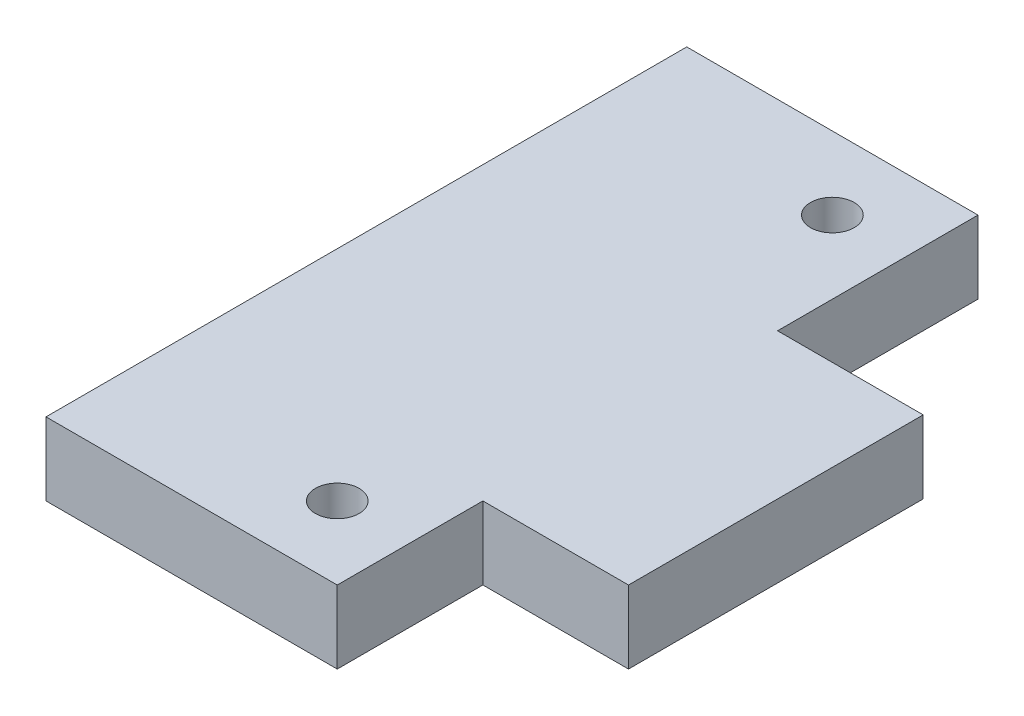
ISO-10303-21;
HEADER;
FILE_DESCRIPTION(('STEP AP214'),'2;1');
FILE_NAME('part.step','',(''),(''),'','','');
FILE_SCHEMA(('AUTOMOTIVE_DESIGN { 1 0 10303 214 1 1 1 1 }'));
ENDSEC;
DATA;
#1=APPLICATION_CONTEXT('core data for automotive mechanical design processes');
#2=APPLICATION_PROTOCOL_DEFINITION('international standard','automotive_design',2000,#1);
#3=PRODUCT_CONTEXT('',#1,'mechanical');
#4=PRODUCT('Part','Part','',(#3));
#5=PRODUCT_RELATED_PRODUCT_CATEGORY('part','',(#4));
#6=PRODUCT_DEFINITION_FORMATION('','',#4);
#7=PRODUCT_DEFINITION_CONTEXT('part definition',#1,'design');
#8=PRODUCT_DEFINITION('design','',#6,#7);
#9=PRODUCT_DEFINITION_SHAPE('','',#8);
#10=(LENGTH_UNIT() NAMED_UNIT(*) SI_UNIT(.MILLI.,.METRE.));
#11=(NAMED_UNIT(*) PLANE_ANGLE_UNIT() SI_UNIT($,.RADIAN.));
#12=(NAMED_UNIT(*) SI_UNIT($,.STERADIAN.) SOLID_ANGLE_UNIT());
#13=UNCERTAINTY_MEASURE_WITH_UNIT(LENGTH_MEASURE(1.E-05),#10,'distance_accuracy_value','');
#14=(GEOMETRIC_REPRESENTATION_CONTEXT(3) GLOBAL_UNCERTAINTY_ASSIGNED_CONTEXT((#13)) GLOBAL_UNIT_ASSIGNED_CONTEXT((#10,
#11,#12)) REPRESENTATION_CONTEXT('',''));
#15=CARTESIAN_POINT('',(0.,0.,0.));
#16=DIRECTION('',(0.,0.,1.));
#17=DIRECTION('',(1.,0.,0.));
#18=AXIS2_PLACEMENT_3D('',#15,#16,#17);
#19=CARTESIAN_POINT('',(0.,10.,0.));
#20=DIRECTION('',(0.,1.,0.));
#21=DIRECTION('',(0.,0.,1.));
#22=AXIS2_PLACEMENT_3D('',#19,#20,#21);
#23=PLANE('',#22);
#24=CARTESIAN_POINT('',(30.,10.,-10.));
#25=DIRECTION('',(0.,1.,0.));
#26=DIRECTION('',(0.,0.,1.));
#27=AXIS2_PLACEMENT_3D('',#24,#25,#26);
#28=CIRCLE('',#27,3.);
#29=CARTESIAN_POINT('',(30.,10.,-7.));
#30=VERTEX_POINT('',#29);
#31=EDGE_CURVE('E146',#30,#30,#28,.T.);
#32=ORIENTED_EDGE('',*,*,#31,.F.);
#33=EDGE_LOOP('',(#32));
#34=FACE_BOUND('',#33,.T.);
#35=DIRECTION('',(0.,0.,1.));
#36=VECTOR('',#35,1.);
#37=CARTESIAN_POINT('',(0.,10.,-88.));
#38=LINE('',#37,#36);
#39=CARTESIAN_POINT('',(0.,10.,-88.));
#40=VERTEX_POINT('',#39);
#41=CARTESIAN_POINT('',(0.,10.,0.));
#42=VERTEX_POINT('',#41);
#43=EDGE_CURVE('E164',#40,#42,#38,.T.);
#44=ORIENTED_EDGE('',*,*,#43,.T.);
#45=DIRECTION('',(1.,0.,0.));
#46=VECTOR('',#45,1.);
#47=CARTESIAN_POINT('',(0.,10.,0.));
#48=LINE('',#47,#46);
#49=CARTESIAN_POINT('',(40.,10.,0.));
#50=VERTEX_POINT('',#49);
#51=EDGE_CURVE('E100',#42,#50,#48,.T.);
#52=ORIENTED_EDGE('',*,*,#51,.T.);
#53=DIRECTION('',(0.,0.,-1.));
#54=VECTOR('',#53,1.);
#55=CARTESIAN_POINT('',(40.,10.,-20.));
#56=LINE('',#55,#54);
#57=CARTESIAN_POINT('',(40.,10.,-20.));
#58=VERTEX_POINT('',#57);
#59=EDGE_CURVE('E185',#50,#58,#56,.T.);
#60=ORIENTED_EDGE('',*,*,#59,.T.);
#61=DIRECTION('',(1.,0.,0.));
#62=VECTOR('',#61,1.);
#63=CARTESIAN_POINT('',(60.,10.,-20.));
#64=LINE('',#63,#62);
#65=CARTESIAN_POINT('',(60.,10.,-20.));
#66=VERTEX_POINT('',#65);
#67=EDGE_CURVE('E199',#58,#66,#64,.T.);
#68=ORIENTED_EDGE('',*,*,#67,.T.);
#69=DIRECTION('',(0.,0.,-1.));
#70=VECTOR('',#69,1.);
#71=CARTESIAN_POINT('',(60.,10.,-60.4728361199811));
#72=LINE('',#71,#70);
#73=CARTESIAN_POINT('',(60.,10.,-60.4728361199811));
#74=VERTEX_POINT('',#73);
#75=EDGE_CURVE('E119',#66,#74,#72,.T.);
#76=ORIENTED_EDGE('',*,*,#75,.T.);
#77=DIRECTION('',(-1.,0.,0.));
#78=VECTOR('',#77,1.);
#79=CARTESIAN_POINT('',(40.,10.,-60.4728361199811));
#80=LINE('',#79,#78);
#81=CARTESIAN_POINT('',(40.,10.,-60.4728361199811));
#82=VERTEX_POINT('',#81);
#83=EDGE_CURVE('E113',#74,#82,#80,.T.);
#84=ORIENTED_EDGE('',*,*,#83,.T.);
#85=DIRECTION('',(0.,0.,-1.));
#86=VECTOR('',#85,1.);
#87=CARTESIAN_POINT('',(40.,10.,-88.));
#88=LINE('',#87,#86);
#89=CARTESIAN_POINT('',(40.,10.,-88.));
#90=VERTEX_POINT('',#89);
#91=EDGE_CURVE('E117',#82,#90,#88,.T.);
#92=ORIENTED_EDGE('',*,*,#91,.T.);
#93=DIRECTION('',(-1.,0.,0.));
#94=VECTOR('',#93,1.);
#95=CARTESIAN_POINT('',(0.,10.,-88.));
#96=LINE('',#95,#94);
#97=EDGE_CURVE('E57',#90,#40,#96,.T.);
#98=ORIENTED_EDGE('',*,*,#97,.T.);
#99=EDGE_LOOP('',(#44,#52,#60,#68,#76,#84,#92,#98));
#100=FACE_BOUND('',#99,.T.);
#101=CARTESIAN_POINT('',(30.,10.,-78.));
#102=DIRECTION('',(0.,1.,0.));
#103=DIRECTION('',(0.,0.,1.));
#104=AXIS2_PLACEMENT_3D('',#101,#102,#103);
#105=CIRCLE('',#104,3.);
#106=CARTESIAN_POINT('',(30.,10.,-75.));
#107=VERTEX_POINT('',#106);
#108=EDGE_CURVE('E213',#107,#107,#105,.T.);
#109=ORIENTED_EDGE('',*,*,#108,.F.);
#110=EDGE_LOOP('',(#109));
#111=FACE_BOUND('',#110,.T.);
#112=ADVANCED_FACE('F39',(#34,#100,#111),#23,.T.);
#113=CARTESIAN_POINT('',(0.,0.,0.));
#114=DIRECTION('',(0.,1.,0.));
#115=DIRECTION('',(0.,0.,1.));
#116=AXIS2_PLACEMENT_3D('',#113,#114,#115);
#117=PLANE('',#116);
#118=DIRECTION('',(0.,0.,1.));
#119=VECTOR('',#118,1.);
#120=CARTESIAN_POINT('',(0.,0.,-88.));
#121=LINE('',#120,#119);
#122=CARTESIAN_POINT('',(0.,0.,-88.));
#123=VERTEX_POINT('',#122);
#124=CARTESIAN_POINT('',(0.,0.,0.));
#125=VERTEX_POINT('',#124);
#126=EDGE_CURVE('E141',#123,#125,#121,.T.);
#127=ORIENTED_EDGE('',*,*,#126,.F.);
#128=DIRECTION('',(-1.,0.,0.));
#129=VECTOR('',#128,1.);
#130=CARTESIAN_POINT('',(0.,0.,-88.));
#131=LINE('',#130,#129);
#132=CARTESIAN_POINT('',(40.,0.,-88.));
#133=VERTEX_POINT('',#132);
#134=EDGE_CURVE('E92',#133,#123,#131,.T.);
#135=ORIENTED_EDGE('',*,*,#134,.F.);
#136=DIRECTION('',(0.,0.,-1.));
#137=VECTOR('',#136,1.);
#138=CARTESIAN_POINT('',(40.,0.,-88.));
#139=LINE('',#138,#137);
#140=CARTESIAN_POINT('',(40.,0.,-60.4728361199811));
#141=VERTEX_POINT('',#140);
#142=EDGE_CURVE('E86',#141,#133,#139,.T.);
#143=ORIENTED_EDGE('',*,*,#142,.F.);
#144=DIRECTION('',(-1.,0.,0.));
#145=VECTOR('',#144,1.);
#146=CARTESIAN_POINT('',(40.,0.,-60.4728361199811));
#147=LINE('',#146,#145);
#148=CARTESIAN_POINT('',(60.,0.,-60.4728361199811));
#149=VERTEX_POINT('',#148);
#150=EDGE_CURVE('E128',#149,#141,#147,.T.);
#151=ORIENTED_EDGE('',*,*,#150,.F.);
#152=DIRECTION('',(0.,0.,-1.));
#153=VECTOR('',#152,1.);
#154=CARTESIAN_POINT('',(60.,0.,-60.4728361199811));
#155=LINE('',#154,#153);
#156=CARTESIAN_POINT('',(60.,0.,-20.));
#157=VERTEX_POINT('',#156);
#158=EDGE_CURVE('E155',#157,#149,#155,.T.);
#159=ORIENTED_EDGE('',*,*,#158,.F.);
#160=DIRECTION('',(1.,0.,0.));
#161=VECTOR('',#160,1.);
#162=CARTESIAN_POINT('',(60.,0.,-20.));
#163=LINE('',#162,#161);
#164=CARTESIAN_POINT('',(40.,0.,-20.));
#165=VERTEX_POINT('',#164);
#166=EDGE_CURVE('E152',#165,#157,#163,.T.);
#167=ORIENTED_EDGE('',*,*,#166,.F.);
#168=DIRECTION('',(0.,0.,-1.));
#169=VECTOR('',#168,1.);
#170=CARTESIAN_POINT('',(40.,0.,-20.));
#171=LINE('',#170,#169);
#172=CARTESIAN_POINT('',(40.,0.,0.));
#173=VERTEX_POINT('',#172);
#174=EDGE_CURVE('E149',#173,#165,#171,.T.);
#175=ORIENTED_EDGE('',*,*,#174,.F.);
#176=DIRECTION('',(1.,0.,0.));
#177=VECTOR('',#176,1.);
#178=CARTESIAN_POINT('',(0.,0.,0.));
#179=LINE('',#178,#177);
#180=EDGE_CURVE('E145',#125,#173,#179,.T.);
#181=ORIENTED_EDGE('',*,*,#180,.F.);
#182=EDGE_LOOP('',(#127,#135,#143,#151,#159,#167,#175,#181));
#183=FACE_BOUND('',#182,.T.);
#184=CARTESIAN_POINT('',(30.,0.,-10.));
#185=DIRECTION('',(0.,1.,0.));
#186=DIRECTION('',(0.,0.,1.));
#187=AXIS2_PLACEMENT_3D('',#184,#185,#186);
#188=CIRCLE('',#187,3.);
#189=CARTESIAN_POINT('',(30.,0.,-7.));
#190=VERTEX_POINT('',#189);
#191=EDGE_CURVE('E209',#190,#190,#188,.T.);
#192=ORIENTED_EDGE('',*,*,#191,.T.);
#193=EDGE_LOOP('',(#192));
#194=FACE_BOUND('',#193,.T.);
#195=CARTESIAN_POINT('',(30.,0.,-78.));
#196=DIRECTION('',(0.,1.,0.));
#197=DIRECTION('',(0.,0.,1.));
#198=AXIS2_PLACEMENT_3D('',#195,#196,#197);
#199=CIRCLE('',#198,3.);
#200=CARTESIAN_POINT('',(30.,0.,-75.));
#201=VERTEX_POINT('',#200);
#202=EDGE_CURVE('E217',#201,#201,#199,.T.);
#203=ORIENTED_EDGE('',*,*,#202,.T.);
#204=EDGE_LOOP('',(#203));
#205=FACE_BOUND('',#204,.T.);
#206=ADVANCED_FACE('F189',(#183,#194,#205),#117,.F.);
#207=CARTESIAN_POINT('',(0.,10.,-88.));
#208=DIRECTION('',(1.,0.,0.));
#209=DIRECTION('',(0.,0.,-1.));
#210=AXIS2_PLACEMENT_3D('',#207,#208,#209);
#211=PLANE('',#210);
#212=ORIENTED_EDGE('',*,*,#126,.T.);
#213=DIRECTION('',(0.,-1.,0.));
#214=VECTOR('',#213,1.);
#215=CARTESIAN_POINT('',(0.,10.,0.));
#216=LINE('',#215,#214);
#217=EDGE_CURVE('E11',#42,#125,#216,.T.);
#218=ORIENTED_EDGE('',*,*,#217,.F.);
#219=ORIENTED_EDGE('',*,*,#43,.F.);
#220=DIRECTION('',(0.,-1.,0.));
#221=VECTOR('',#220,1.);
#222=CARTESIAN_POINT('',(0.,10.,-88.));
#223=LINE('',#222,#221);
#224=EDGE_CURVE('E137',#40,#123,#223,.T.);
#225=ORIENTED_EDGE('',*,*,#224,.T.);
#226=EDGE_LOOP('',(#212,#218,#219,#225));
#227=FACE_BOUND('',#226,.T.);
#228=ADVANCED_FACE('F41',(#227),#211,.F.);
#229=CARTESIAN_POINT('',(0.,10.,0.));
#230=DIRECTION('',(0.,0.,-1.));
#231=DIRECTION('',(-1.,0.,0.));
#232=AXIS2_PLACEMENT_3D('',#229,#230,#231);
#233=PLANE('',#232);
#234=ORIENTED_EDGE('',*,*,#180,.T.);
#235=DIRECTION('',(0.,-1.,0.));
#236=VECTOR('',#235,1.);
#237=CARTESIAN_POINT('',(40.,10.,0.));
#238=LINE('',#237,#236);
#239=EDGE_CURVE('E49',#50,#173,#238,.T.);
#240=ORIENTED_EDGE('',*,*,#239,.F.);
#241=ORIENTED_EDGE('',*,*,#51,.F.);
#242=ORIENTED_EDGE('',*,*,#217,.T.);
#243=EDGE_LOOP('',(#234,#240,#241,#242));
#244=FACE_BOUND('',#243,.T.);
#245=ADVANCED_FACE('F251',(#244),#233,.F.);
#246=CARTESIAN_POINT('',(40.,10.,-20.));
#247=DIRECTION('',(-1.,0.,0.));
#248=DIRECTION('',(0.,0.,1.));
#249=AXIS2_PLACEMENT_3D('',#246,#247,#248);
#250=PLANE('',#249);
#251=ORIENTED_EDGE('',*,*,#174,.T.);
#252=DIRECTION('',(0.,-1.,0.));
#253=VECTOR('',#252,1.);
#254=CARTESIAN_POINT('',(40.,10.,-20.));
#255=LINE('',#254,#253);
#256=EDGE_CURVE('E175',#58,#165,#255,.T.);
#257=ORIENTED_EDGE('',*,*,#256,.F.);
#258=ORIENTED_EDGE('',*,*,#59,.F.);
#259=ORIENTED_EDGE('',*,*,#239,.T.);
#260=EDGE_LOOP('',(#251,#257,#258,#259));
#261=FACE_BOUND('',#260,.T.);
#262=ADVANCED_FACE('F183',(#261),#250,.F.);
#263=CARTESIAN_POINT('',(60.,10.,-20.));
#264=DIRECTION('',(0.,0.,-1.));
#265=DIRECTION('',(-1.,0.,0.));
#266=AXIS2_PLACEMENT_3D('',#263,#264,#265);
#267=PLANE('',#266);
#268=ORIENTED_EDGE('',*,*,#166,.T.);
#269=DIRECTION('',(0.,-1.,0.));
#270=VECTOR('',#269,1.);
#271=CARTESIAN_POINT('',(60.,10.,-20.));
#272=LINE('',#271,#270);
#273=EDGE_CURVE('E171',#66,#157,#272,.T.);
#274=ORIENTED_EDGE('',*,*,#273,.F.);
#275=ORIENTED_EDGE('',*,*,#67,.F.);
#276=ORIENTED_EDGE('',*,*,#256,.T.);
#277=EDGE_LOOP('',(#268,#274,#275,#276));
#278=FACE_BOUND('',#277,.T.);
#279=ADVANCED_FACE('F194',(#278),#267,.F.);
#280=CARTESIAN_POINT('',(60.,10.,-60.4728361199811));
#281=DIRECTION('',(-1.,0.,0.));
#282=DIRECTION('',(0.,0.,1.));
#283=AXIS2_PLACEMENT_3D('',#280,#281,#282);
#284=PLANE('',#283);
#285=ORIENTED_EDGE('',*,*,#158,.T.);
#286=DIRECTION('',(0.,-1.,0.));
#287=VECTOR('',#286,1.);
#288=CARTESIAN_POINT('',(60.,10.,-60.4728361199811));
#289=LINE('',#288,#287);
#290=EDGE_CURVE('E130',#74,#149,#289,.T.);
#291=ORIENTED_EDGE('',*,*,#290,.F.);
#292=ORIENTED_EDGE('',*,*,#75,.F.);
#293=ORIENTED_EDGE('',*,*,#273,.T.);
#294=EDGE_LOOP('',(#285,#291,#292,#293));
#295=FACE_BOUND('',#294,.T.);
#296=ADVANCED_FACE('F197',(#295),#284,.F.);
#297=CARTESIAN_POINT('',(40.,10.,-60.4728361199811));
#298=DIRECTION('',(0.,0.,1.));
#299=DIRECTION('',(1.,0.,0.));
#300=AXIS2_PLACEMENT_3D('',#297,#298,#299);
#301=PLANE('',#300);
#302=ORIENTED_EDGE('',*,*,#150,.T.);
#303=DIRECTION('',(0.,-1.,0.));
#304=VECTOR('',#303,1.);
#305=CARTESIAN_POINT('',(40.,10.,-60.4728361199811));
#306=LINE('',#305,#304);
#307=EDGE_CURVE('E125',#82,#141,#306,.T.);
#308=ORIENTED_EDGE('',*,*,#307,.F.);
#309=ORIENTED_EDGE('',*,*,#83,.F.);
#310=ORIENTED_EDGE('',*,*,#290,.T.);
#311=EDGE_LOOP('',(#302,#308,#309,#310));
#312=FACE_BOUND('',#311,.T.);
#313=ADVANCED_FACE('F126',(#312),#301,.F.);
#314=CARTESIAN_POINT('',(40.,10.,-88.));
#315=DIRECTION('',(-1.,0.,0.));
#316=DIRECTION('',(0.,0.,1.));
#317=AXIS2_PLACEMENT_3D('',#314,#315,#316);
#318=PLANE('',#317);
#319=ORIENTED_EDGE('',*,*,#142,.T.);
#320=DIRECTION('',(0.,-1.,0.));
#321=VECTOR('',#320,1.);
#322=CARTESIAN_POINT('',(40.,10.,-88.));
#323=LINE('',#322,#321);
#324=EDGE_CURVE('E131',#90,#133,#323,.T.);
#325=ORIENTED_EDGE('',*,*,#324,.F.);
#326=ORIENTED_EDGE('',*,*,#91,.F.);
#327=ORIENTED_EDGE('',*,*,#307,.T.);
#328=EDGE_LOOP('',(#319,#325,#326,#327));
#329=FACE_BOUND('',#328,.T.);
#330=ADVANCED_FACE('F133',(#329),#318,.F.);
#331=CARTESIAN_POINT('',(0.,10.,-88.));
#332=DIRECTION('',(0.,0.,1.));
#333=DIRECTION('',(1.,0.,0.));
#334=AXIS2_PLACEMENT_3D('',#331,#332,#333);
#335=PLANE('',#334);
#336=ORIENTED_EDGE('',*,*,#134,.T.);
#337=ORIENTED_EDGE('',*,*,#224,.F.);
#338=ORIENTED_EDGE('',*,*,#97,.F.);
#339=ORIENTED_EDGE('',*,*,#324,.T.);
#340=EDGE_LOOP('',(#336,#337,#338,#339));
#341=FACE_BOUND('',#340,.T.);
#342=ADVANCED_FACE('F239',(#341),#335,.F.);
#343=CARTESIAN_POINT('',(30.,10.,-10.));
#344=DIRECTION('',(0.,-1.,0.));
#345=DIRECTION('',(0.,0.,-1.));
#346=AXIS2_PLACEMENT_3D('',#343,#344,#345);
#347=CYLINDRICAL_SURFACE('',#346,3.);
#348=ORIENTED_EDGE('',*,*,#31,.T.);
#349=EDGE_LOOP('',(#348));
#350=FACE_BOUND('',#349,.T.);
#351=ORIENTED_EDGE('',*,*,#191,.F.);
#352=EDGE_LOOP('',(#351));
#353=FACE_BOUND('',#352,.T.);
#354=ADVANCED_FACE('F236',(#350,#353),#347,.F.);
#355=CARTESIAN_POINT('',(30.,10.,-78.));
#356=DIRECTION('',(0.,-1.,0.));
#357=DIRECTION('',(0.,0.,-1.));
#358=AXIS2_PLACEMENT_3D('',#355,#356,#357);
#359=CYLINDRICAL_SURFACE('',#358,3.);
#360=ORIENTED_EDGE('',*,*,#108,.T.);
#361=EDGE_LOOP('',(#360));
#362=FACE_BOUND('',#361,.T.);
#363=ORIENTED_EDGE('',*,*,#202,.F.);
#364=EDGE_LOOP('',(#363));
#365=FACE_BOUND('',#364,.T.);
#366=ADVANCED_FACE('F225',(#362,#365),#359,.F.);
#367=CLOSED_SHELL('',(#112,#206,#228,#245,#262,#279,#296,#313,#330,#342,#354,#366));
#368=MANIFOLD_SOLID_BREP('B2',#367);
#369=ADVANCED_BREP_SHAPE_REPRESENTATION('',(#18,#368),#14);
#370=SHAPE_DEFINITION_REPRESENTATION(#9,#369);
ENDSEC;
END-ISO-10303-21;
